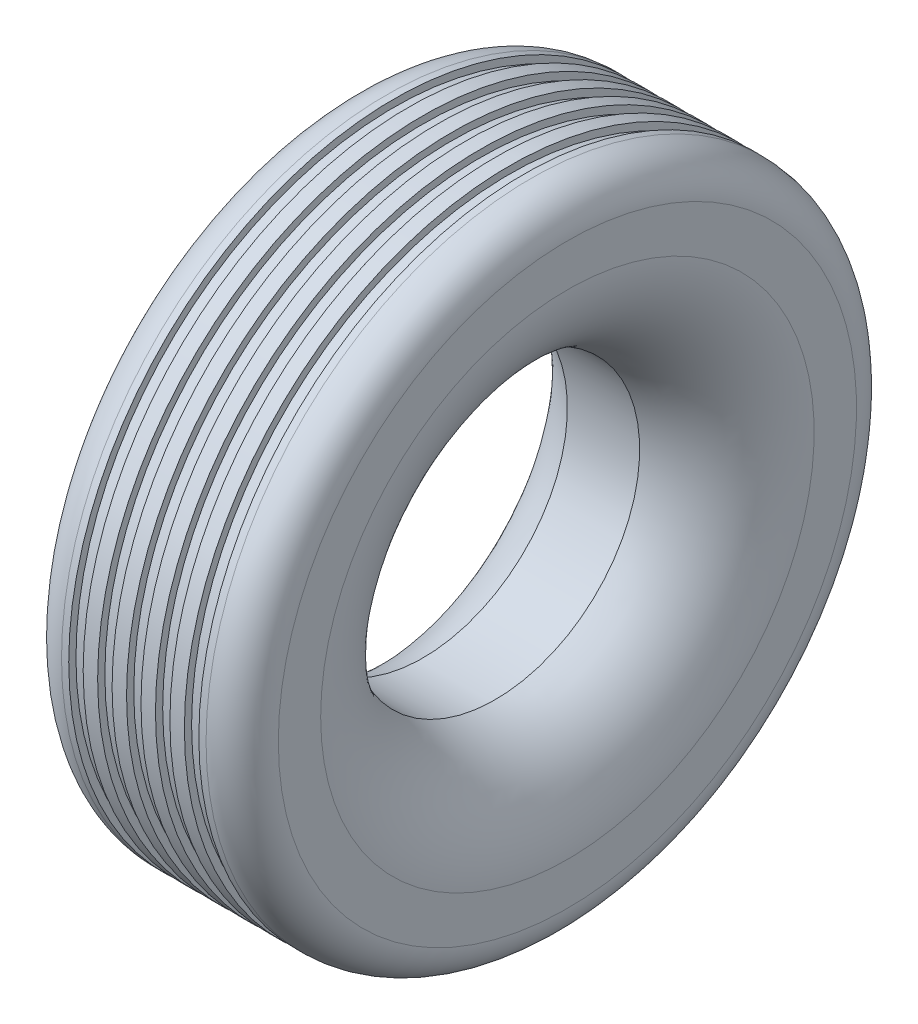
ISO-10303-21;
HEADER;
FILE_DESCRIPTION(('STEP AP214'),'2;1');
FILE_NAME('part.step','',(''),(''),'','','');
FILE_SCHEMA(('AUTOMOTIVE_DESIGN { 1 0 10303 214 1 1 1 1 }'));
ENDSEC;
DATA;
#1=APPLICATION_CONTEXT('core data for automotive mechanical design processes');
#2=APPLICATION_PROTOCOL_DEFINITION('international standard','automotive_design',2000,#1);
#3=PRODUCT_CONTEXT('',#1,'mechanical');
#4=PRODUCT('Part','Part','',(#3));
#5=PRODUCT_RELATED_PRODUCT_CATEGORY('part','',(#4));
#6=PRODUCT_DEFINITION_FORMATION('','',#4);
#7=PRODUCT_DEFINITION_CONTEXT('part definition',#1,'design');
#8=PRODUCT_DEFINITION('design','',#6,#7);
#9=PRODUCT_DEFINITION_SHAPE('','',#8);
#10=(LENGTH_UNIT() NAMED_UNIT(*) SI_UNIT(.MILLI.,.METRE.));
#11=(NAMED_UNIT(*) PLANE_ANGLE_UNIT() SI_UNIT($,.RADIAN.));
#12=(NAMED_UNIT(*) SI_UNIT($,.STERADIAN.) SOLID_ANGLE_UNIT());
#13=UNCERTAINTY_MEASURE_WITH_UNIT(LENGTH_MEASURE(1.E-05),#10,'distance_accuracy_value','');
#14=(GEOMETRIC_REPRESENTATION_CONTEXT(3) GLOBAL_UNCERTAINTY_ASSIGNED_CONTEXT((#13)) GLOBAL_UNIT_ASSIGNED_CONTEXT((#10,
#11,#12)) REPRESENTATION_CONTEXT('',''));
#15=CARTESIAN_POINT('',(0.,0.,0.));
#16=DIRECTION('',(0.,0.,1.));
#17=DIRECTION('',(1.,0.,0.));
#18=AXIS2_PLACEMENT_3D('',#15,#16,#17);
#19=CARTESIAN_POINT('',(100.,0.,0.));
#20=DIRECTION('',(-1.,0.,0.));
#21=DIRECTION('',(0.,0.,1.));
#22=AXIS2_PLACEMENT_3D('',#19,#20,#21);
#23=CYLINDRICAL_SURFACE('',#22,450.);
#24=CARTESIAN_POINT('',(50.0000000000003,0.,0.));
#25=DIRECTION('',(-1.,0.,0.));
#26=DIRECTION('',(0.,0.,1.));
#27=AXIS2_PLACEMENT_3D('',#24,#25,#26);
#28=CIRCLE('',#27,450.);
#29=CARTESIAN_POINT('',(50.0000000000003,0.,450.));
#30=VERTEX_POINT('',#29);
#31=EDGE_CURVE('E112',#30,#30,#28,.T.);
#32=ORIENTED_EDGE('',*,*,#31,.F.);
#33=EDGE_LOOP('',(#32));
#34=FACE_BOUND('',#33,.T.);
#35=CARTESIAN_POINT('',(60.0000000000004,0.,0.));
#36=DIRECTION('',(-1.,0.,0.));
#37=DIRECTION('',(0.,0.,1.));
#38=AXIS2_PLACEMENT_3D('',#35,#36,#37);
#39=CIRCLE('',#38,450.);
#40=CARTESIAN_POINT('',(60.0000000000004,0.,450.));
#41=VERTEX_POINT('',#40);
#42=EDGE_CURVE('E10',#41,#41,#39,.T.);
#43=ORIENTED_EDGE('',*,*,#42,.T.);
#44=EDGE_LOOP('',(#43));
#45=FACE_BOUND('',#44,.T.);
#46=ADVANCED_FACE('F30',(#34,#45),#23,.T.);
#47=CARTESIAN_POINT('',(60.0000000000004,450.,0.));
#48=DIRECTION('',(-1.,0.,0.));
#49=DIRECTION('',(0.,0.,1.));
#50=AXIS2_PLACEMENT_3D('',#47,#48,#49);
#51=PLANE('',#50);
#52=ORIENTED_EDGE('',*,*,#42,.F.);
#53=EDGE_LOOP('',(#52));
#54=FACE_BOUND('',#53,.T.);
#55=CARTESIAN_POINT('',(60.0000000000004,0.,0.));
#56=DIRECTION('',(-1.,0.,0.));
#57=DIRECTION('',(0.,0.,1.));
#58=AXIS2_PLACEMENT_3D('',#55,#56,#57);
#59=CIRCLE('',#58,440.);
#60=CARTESIAN_POINT('',(60.0000000000004,0.,440.));
#61=VERTEX_POINT('',#60);
#62=EDGE_CURVE('E36',#61,#61,#59,.T.);
#63=ORIENTED_EDGE('',*,*,#62,.T.);
#64=EDGE_LOOP('',(#63));
#65=FACE_BOUND('',#64,.T.);
#66=ADVANCED_FACE('F145',(#54,#65),#51,.F.);
#67=CARTESIAN_POINT('',(100.,0.,0.));
#68=DIRECTION('',(-1.,0.,0.));
#69=DIRECTION('',(0.,0.,1.));
#70=AXIS2_PLACEMENT_3D('',#67,#68,#69);
#71=CYLINDRICAL_SURFACE('',#70,440.);
#72=ORIENTED_EDGE('',*,*,#62,.F.);
#73=EDGE_LOOP('',(#72));
#74=FACE_BOUND('',#73,.T.);
#75=CARTESIAN_POINT('',(80.0000000000004,0.,0.));
#76=DIRECTION('',(-1.,0.,0.));
#77=DIRECTION('',(0.,0.,1.));
#78=AXIS2_PLACEMENT_3D('',#75,#76,#77);
#79=CIRCLE('',#78,440.);
#80=CARTESIAN_POINT('',(80.0000000000004,0.,440.));
#81=VERTEX_POINT('',#80);
#82=EDGE_CURVE('E40',#81,#81,#79,.T.);
#83=ORIENTED_EDGE('',*,*,#82,.T.);
#84=EDGE_LOOP('',(#83));
#85=FACE_BOUND('',#84,.T.);
#86=ADVANCED_FACE('F149',(#74,#85),#71,.T.);
#87=CARTESIAN_POINT('',(80.0000000000004,440.,0.));
#88=DIRECTION('',(1.,0.,0.));
#89=DIRECTION('',(0.,0.,-1.));
#90=AXIS2_PLACEMENT_3D('',#87,#88,#89);
#91=PLANE('',#90);
#92=ORIENTED_EDGE('',*,*,#82,.F.);
#93=EDGE_LOOP('',(#92));
#94=FACE_BOUND('',#93,.T.);
#95=CARTESIAN_POINT('',(80.0000000000004,0.,0.));
#96=DIRECTION('',(-1.,0.,0.));
#97=DIRECTION('',(0.,0.,1.));
#98=AXIS2_PLACEMENT_3D('',#95,#96,#97);
#99=CIRCLE('',#98,450.);
#100=CARTESIAN_POINT('',(80.0000000000004,0.,450.));
#101=VERTEX_POINT('',#100);
#102=EDGE_CURVE('E44',#101,#101,#99,.T.);
#103=ORIENTED_EDGE('',*,*,#102,.T.);
#104=EDGE_LOOP('',(#103));
#105=FACE_BOUND('',#104,.T.);
#106=ADVANCED_FACE('F154',(#94,#105),#91,.F.);
#107=CARTESIAN_POINT('',(100.,0.,0.));
#108=DIRECTION('',(-1.,0.,0.));
#109=DIRECTION('',(0.,0.,1.));
#110=AXIS2_PLACEMENT_3D('',#107,#108,#109);
#111=CYLINDRICAL_SURFACE('',#110,450.);
#112=ORIENTED_EDGE('',*,*,#102,.F.);
#113=EDGE_LOOP('',(#112));
#114=FACE_BOUND('',#113,.T.);
#115=CARTESIAN_POINT('',(100.,0.,0.));
#116=DIRECTION('',(-1.,0.,0.));
#117=DIRECTION('',(0.,0.,1.));
#118=AXIS2_PLACEMENT_3D('',#115,#116,#117);
#119=CIRCLE('',#118,450.);
#120=CARTESIAN_POINT('',(100.,0.,450.));
#121=VERTEX_POINT('',#120);
#122=EDGE_CURVE('E49',#121,#121,#119,.T.);
#123=ORIENTED_EDGE('',*,*,#122,.T.);
#124=EDGE_LOOP('',(#123));
#125=FACE_BOUND('',#124,.T.);
#126=ADVANCED_FACE('F160',(#114,#125),#111,.T.);
#127=CARTESIAN_POINT('',(100.,450.,0.));
#128=DIRECTION('',(-1.,0.,0.));
#129=DIRECTION('',(0.,0.,1.));
#130=AXIS2_PLACEMENT_3D('',#127,#128,#129);
#131=PLANE('',#130);
#132=ORIENTED_EDGE('',*,*,#122,.F.);
#133=EDGE_LOOP('',(#132));
#134=FACE_BOUND('',#133,.T.);
#135=CARTESIAN_POINT('',(100.,0.,0.));
#136=DIRECTION('',(-1.,0.,0.));
#137=DIRECTION('',(0.,0.,1.));
#138=AXIS2_PLACEMENT_3D('',#135,#136,#137);
#139=CIRCLE('',#138,440.);
#140=CARTESIAN_POINT('',(100.,0.,440.));
#141=VERTEX_POINT('',#140);
#142=EDGE_CURVE('E52',#141,#141,#139,.T.);
#143=ORIENTED_EDGE('',*,*,#142,.T.);
#144=EDGE_LOOP('',(#143));
#145=FACE_BOUND('',#144,.T.);
#146=ADVANCED_FACE('F164',(#134,#145),#131,.F.);
#147=CARTESIAN_POINT('',(100.,0.,0.));
#148=DIRECTION('',(-1.,0.,0.));
#149=DIRECTION('',(0.,0.,1.));
#150=AXIS2_PLACEMENT_3D('',#147,#148,#149);
#151=CYLINDRICAL_SURFACE('',#150,440.);
#152=ORIENTED_EDGE('',*,*,#142,.F.);
#153=EDGE_LOOP('',(#152));
#154=FACE_BOUND('',#153,.T.);
#155=CARTESIAN_POINT('',(120.,0.,0.));
#156=DIRECTION('',(-1.,0.,0.));
#157=DIRECTION('',(0.,0.,1.));
#158=AXIS2_PLACEMENT_3D('',#155,#156,#157);
#159=CIRCLE('',#158,440.);
#160=CARTESIAN_POINT('',(120.,0.,440.));
#161=VERTEX_POINT('',#160);
#162=EDGE_CURVE('E55',#161,#161,#159,.T.);
#163=ORIENTED_EDGE('',*,*,#162,.T.);
#164=EDGE_LOOP('',(#163));
#165=FACE_BOUND('',#164,.T.);
#166=ADVANCED_FACE('F168',(#154,#165),#151,.T.);
#167=CARTESIAN_POINT('',(120.,440.,0.));
#168=DIRECTION('',(1.,0.,0.));
#169=DIRECTION('',(0.,0.,-1.));
#170=AXIS2_PLACEMENT_3D('',#167,#168,#169);
#171=PLANE('',#170);
#172=ORIENTED_EDGE('',*,*,#162,.F.);
#173=EDGE_LOOP('',(#172));
#174=FACE_BOUND('',#173,.T.);
#175=CARTESIAN_POINT('',(120.,0.,0.));
#176=DIRECTION('',(-1.,0.,0.));
#177=DIRECTION('',(0.,0.,1.));
#178=AXIS2_PLACEMENT_3D('',#175,#176,#177);
#179=CIRCLE('',#178,450.);
#180=CARTESIAN_POINT('',(120.,0.,450.));
#181=VERTEX_POINT('',#180);
#182=EDGE_CURVE('E58',#181,#181,#179,.T.);
#183=ORIENTED_EDGE('',*,*,#182,.T.);
#184=EDGE_LOOP('',(#183));
#185=FACE_BOUND('',#184,.T.);
#186=ADVANCED_FACE('F172',(#174,#185),#171,.F.);
#187=CARTESIAN_POINT('',(100.,0.,0.));
#188=DIRECTION('',(-1.,0.,0.));
#189=DIRECTION('',(0.,0.,1.));
#190=AXIS2_PLACEMENT_3D('',#187,#188,#189);
#191=CYLINDRICAL_SURFACE('',#190,450.);
#192=ORIENTED_EDGE('',*,*,#182,.F.);
#193=EDGE_LOOP('',(#192));
#194=FACE_BOUND('',#193,.T.);
#195=CARTESIAN_POINT('',(140.,0.,0.));
#196=DIRECTION('',(-1.,0.,0.));
#197=DIRECTION('',(0.,0.,1.));
#198=AXIS2_PLACEMENT_3D('',#195,#196,#197);
#199=CIRCLE('',#198,450.);
#200=CARTESIAN_POINT('',(140.,0.,450.));
#201=VERTEX_POINT('',#200);
#202=EDGE_CURVE('E61',#201,#201,#199,.T.);
#203=ORIENTED_EDGE('',*,*,#202,.T.);
#204=EDGE_LOOP('',(#203));
#205=FACE_BOUND('',#204,.T.);
#206=ADVANCED_FACE('F176',(#194,#205),#191,.T.);
#207=CARTESIAN_POINT('',(140.,450.,0.));
#208=DIRECTION('',(-1.,0.,0.));
#209=DIRECTION('',(0.,0.,1.));
#210=AXIS2_PLACEMENT_3D('',#207,#208,#209);
#211=PLANE('',#210);
#212=ORIENTED_EDGE('',*,*,#202,.F.);
#213=EDGE_LOOP('',(#212));
#214=FACE_BOUND('',#213,.T.);
#215=CARTESIAN_POINT('',(140.,0.,0.));
#216=DIRECTION('',(-1.,0.,0.));
#217=DIRECTION('',(0.,0.,1.));
#218=AXIS2_PLACEMENT_3D('',#215,#216,#217);
#219=CIRCLE('',#218,440.);
#220=CARTESIAN_POINT('',(140.,0.,440.));
#221=VERTEX_POINT('',#220);
#222=EDGE_CURVE('E64',#221,#221,#219,.T.);
#223=ORIENTED_EDGE('',*,*,#222,.T.);
#224=EDGE_LOOP('',(#223));
#225=FACE_BOUND('',#224,.T.);
#226=ADVANCED_FACE('F180',(#214,#225),#211,.F.);
#227=CARTESIAN_POINT('',(100.,0.,0.));
#228=DIRECTION('',(-1.,0.,0.));
#229=DIRECTION('',(0.,0.,1.));
#230=AXIS2_PLACEMENT_3D('',#227,#228,#229);
#231=CYLINDRICAL_SURFACE('',#230,440.);
#232=ORIENTED_EDGE('',*,*,#222,.F.);
#233=EDGE_LOOP('',(#232));
#234=FACE_BOUND('',#233,.T.);
#235=CARTESIAN_POINT('',(160.,0.,0.));
#236=DIRECTION('',(-1.,0.,0.));
#237=DIRECTION('',(0.,0.,1.));
#238=AXIS2_PLACEMENT_3D('',#235,#236,#237);
#239=CIRCLE('',#238,440.);
#240=CARTESIAN_POINT('',(160.,0.,440.));
#241=VERTEX_POINT('',#240);
#242=EDGE_CURVE('E67',#241,#241,#239,.T.);
#243=ORIENTED_EDGE('',*,*,#242,.T.);
#244=EDGE_LOOP('',(#243));
#245=FACE_BOUND('',#244,.T.);
#246=ADVANCED_FACE('F184',(#234,#245),#231,.T.);
#247=CARTESIAN_POINT('',(160.,440.,0.));
#248=DIRECTION('',(1.,0.,0.));
#249=DIRECTION('',(0.,0.,-1.));
#250=AXIS2_PLACEMENT_3D('',#247,#248,#249);
#251=PLANE('',#250);
#252=ORIENTED_EDGE('',*,*,#242,.F.);
#253=EDGE_LOOP('',(#252));
#254=FACE_BOUND('',#253,.T.);
#255=CARTESIAN_POINT('',(160.,0.,0.));
#256=DIRECTION('',(-1.,0.,0.));
#257=DIRECTION('',(0.,0.,1.));
#258=AXIS2_PLACEMENT_3D('',#255,#256,#257);
#259=CIRCLE('',#258,450.);
#260=CARTESIAN_POINT('',(160.,0.,450.));
#261=VERTEX_POINT('',#260);
#262=EDGE_CURVE('E70',#261,#261,#259,.T.);
#263=ORIENTED_EDGE('',*,*,#262,.T.);
#264=EDGE_LOOP('',(#263));
#265=FACE_BOUND('',#264,.T.);
#266=ADVANCED_FACE('F188',(#254,#265),#251,.F.);
#267=CARTESIAN_POINT('',(100.,0.,0.));
#268=DIRECTION('',(-1.,0.,0.));
#269=DIRECTION('',(0.,0.,1.));
#270=AXIS2_PLACEMENT_3D('',#267,#268,#269);
#271=CYLINDRICAL_SURFACE('',#270,450.);
#272=ORIENTED_EDGE('',*,*,#262,.F.);
#273=EDGE_LOOP('',(#272));
#274=FACE_BOUND('',#273,.T.);
#275=CARTESIAN_POINT('',(180.,0.,0.));
#276=DIRECTION('',(-1.,0.,0.));
#277=DIRECTION('',(0.,0.,1.));
#278=AXIS2_PLACEMENT_3D('',#275,#276,#277);
#279=CIRCLE('',#278,450.);
#280=CARTESIAN_POINT('',(180.,0.,450.));
#281=VERTEX_POINT('',#280);
#282=EDGE_CURVE('E73',#281,#281,#279,.T.);
#283=ORIENTED_EDGE('',*,*,#282,.T.);
#284=EDGE_LOOP('',(#283));
#285=FACE_BOUND('',#284,.T.);
#286=ADVANCED_FACE('F192',(#274,#285),#271,.T.);
#287=CARTESIAN_POINT('',(180.,450.,0.));
#288=DIRECTION('',(-1.,0.,0.));
#289=DIRECTION('',(0.,0.,1.));
#290=AXIS2_PLACEMENT_3D('',#287,#288,#289);
#291=PLANE('',#290);
#292=ORIENTED_EDGE('',*,*,#282,.F.);
#293=EDGE_LOOP('',(#292));
#294=FACE_BOUND('',#293,.T.);
#295=CARTESIAN_POINT('',(180.,0.,0.));
#296=DIRECTION('',(-1.,0.,0.));
#297=DIRECTION('',(0.,0.,1.));
#298=AXIS2_PLACEMENT_3D('',#295,#296,#297);
#299=CIRCLE('',#298,440.);
#300=CARTESIAN_POINT('',(180.,0.,440.));
#301=VERTEX_POINT('',#300);
#302=EDGE_CURVE('E76',#301,#301,#299,.T.);
#303=ORIENTED_EDGE('',*,*,#302,.T.);
#304=EDGE_LOOP('',(#303));
#305=FACE_BOUND('',#304,.T.);
#306=ADVANCED_FACE('F196',(#294,#305),#291,.F.);
#307=CARTESIAN_POINT('',(100.,0.,0.));
#308=DIRECTION('',(-1.,0.,0.));
#309=DIRECTION('',(0.,0.,1.));
#310=AXIS2_PLACEMENT_3D('',#307,#308,#309);
#311=CYLINDRICAL_SURFACE('',#310,440.);
#312=ORIENTED_EDGE('',*,*,#302,.F.);
#313=EDGE_LOOP('',(#312));
#314=FACE_BOUND('',#313,.T.);
#315=CARTESIAN_POINT('',(200.,0.,0.));
#316=DIRECTION('',(-1.,0.,0.));
#317=DIRECTION('',(0.,0.,1.));
#318=AXIS2_PLACEMENT_3D('',#315,#316,#317);
#319=CIRCLE('',#318,440.);
#320=CARTESIAN_POINT('',(200.,0.,440.));
#321=VERTEX_POINT('',#320);
#322=EDGE_CURVE('E79',#321,#321,#319,.T.);
#323=ORIENTED_EDGE('',*,*,#322,.T.);
#324=EDGE_LOOP('',(#323));
#325=FACE_BOUND('',#324,.T.);
#326=ADVANCED_FACE('F200',(#314,#325),#311,.T.);
#327=CARTESIAN_POINT('',(200.,440.,0.));
#328=DIRECTION('',(1.,0.,0.));
#329=DIRECTION('',(0.,0.,-1.));
#330=AXIS2_PLACEMENT_3D('',#327,#328,#329);
#331=PLANE('',#330);
#332=ORIENTED_EDGE('',*,*,#322,.F.);
#333=EDGE_LOOP('',(#332));
#334=FACE_BOUND('',#333,.T.);
#335=CARTESIAN_POINT('',(200.,0.,0.));
#336=DIRECTION('',(-1.,0.,0.));
#337=DIRECTION('',(0.,0.,1.));
#338=AXIS2_PLACEMENT_3D('',#335,#336,#337);
#339=CIRCLE('',#338,450.);
#340=CARTESIAN_POINT('',(200.,0.,450.));
#341=VERTEX_POINT('',#340);
#342=EDGE_CURVE('E82',#341,#341,#339,.T.);
#343=ORIENTED_EDGE('',*,*,#342,.T.);
#344=EDGE_LOOP('',(#343));
#345=FACE_BOUND('',#344,.T.);
#346=ADVANCED_FACE('F204',(#334,#345),#331,.F.);
#347=CARTESIAN_POINT('',(100.,0.,0.));
#348=DIRECTION('',(-1.,0.,0.));
#349=DIRECTION('',(0.,0.,1.));
#350=AXIS2_PLACEMENT_3D('',#347,#348,#349);
#351=CYLINDRICAL_SURFACE('',#350,450.);
#352=ORIENTED_EDGE('',*,*,#342,.F.);
#353=EDGE_LOOP('',(#352));
#354=FACE_BOUND('',#353,.T.);
#355=CARTESIAN_POINT('',(220.,0.,0.));
#356=DIRECTION('',(-1.,0.,0.));
#357=DIRECTION('',(0.,0.,1.));
#358=AXIS2_PLACEMENT_3D('',#355,#356,#357);
#359=CIRCLE('',#358,450.);
#360=CARTESIAN_POINT('',(220.,0.,450.));
#361=VERTEX_POINT('',#360);
#362=EDGE_CURVE('E85',#361,#361,#359,.T.);
#363=ORIENTED_EDGE('',*,*,#362,.T.);
#364=EDGE_LOOP('',(#363));
#365=FACE_BOUND('',#364,.T.);
#366=ADVANCED_FACE('F208',(#354,#365),#351,.T.);
#367=CARTESIAN_POINT('',(220.,450.,0.));
#368=DIRECTION('',(-1.,0.,0.));
#369=DIRECTION('',(0.,0.,1.));
#370=AXIS2_PLACEMENT_3D('',#367,#368,#369);
#371=PLANE('',#370);
#372=ORIENTED_EDGE('',*,*,#362,.F.);
#373=EDGE_LOOP('',(#372));
#374=FACE_BOUND('',#373,.T.);
#375=CARTESIAN_POINT('',(220.,0.,0.));
#376=DIRECTION('',(-1.,0.,0.));
#377=DIRECTION('',(0.,0.,1.));
#378=AXIS2_PLACEMENT_3D('',#375,#376,#377);
#379=CIRCLE('',#378,440.);
#380=CARTESIAN_POINT('',(220.,0.,440.));
#381=VERTEX_POINT('',#380);
#382=EDGE_CURVE('E88',#381,#381,#379,.T.);
#383=ORIENTED_EDGE('',*,*,#382,.T.);
#384=EDGE_LOOP('',(#383));
#385=FACE_BOUND('',#384,.T.);
#386=ADVANCED_FACE('F212',(#374,#385),#371,.F.);
#387=CARTESIAN_POINT('',(100.,0.,0.));
#388=DIRECTION('',(-1.,0.,0.));
#389=DIRECTION('',(0.,0.,1.));
#390=AXIS2_PLACEMENT_3D('',#387,#388,#389);
#391=CYLINDRICAL_SURFACE('',#390,440.);
#392=ORIENTED_EDGE('',*,*,#382,.F.);
#393=EDGE_LOOP('',(#392));
#394=FACE_BOUND('',#393,.T.);
#395=CARTESIAN_POINT('',(240.,0.,0.));
#396=DIRECTION('',(-1.,0.,0.));
#397=DIRECTION('',(0.,0.,1.));
#398=AXIS2_PLACEMENT_3D('',#395,#396,#397);
#399=CIRCLE('',#398,440.);
#400=CARTESIAN_POINT('',(240.,0.,440.));
#401=VERTEX_POINT('',#400);
#402=EDGE_CURVE('E91',#401,#401,#399,.T.);
#403=ORIENTED_EDGE('',*,*,#402,.T.);
#404=EDGE_LOOP('',(#403));
#405=FACE_BOUND('',#404,.T.);
#406=ADVANCED_FACE('F216',(#394,#405),#391,.T.);
#407=CARTESIAN_POINT('',(240.,440.,0.));
#408=DIRECTION('',(1.,0.,0.));
#409=DIRECTION('',(0.,0.,-1.));
#410=AXIS2_PLACEMENT_3D('',#407,#408,#409);
#411=PLANE('',#410);
#412=ORIENTED_EDGE('',*,*,#402,.F.);
#413=EDGE_LOOP('',(#412));
#414=FACE_BOUND('',#413,.T.);
#415=CARTESIAN_POINT('',(240.,0.,0.));
#416=DIRECTION('',(-1.,0.,0.));
#417=DIRECTION('',(0.,0.,1.));
#418=AXIS2_PLACEMENT_3D('',#415,#416,#417);
#419=CIRCLE('',#418,450.);
#420=CARTESIAN_POINT('',(240.,0.,450.));
#421=VERTEX_POINT('',#420);
#422=EDGE_CURVE('E94',#421,#421,#419,.T.);
#423=ORIENTED_EDGE('',*,*,#422,.T.);
#424=EDGE_LOOP('',(#423));
#425=FACE_BOUND('',#424,.T.);
#426=ADVANCED_FACE('F220',(#414,#425),#411,.F.);
#427=CARTESIAN_POINT('',(100.,0.,0.));
#428=DIRECTION('',(-1.,0.,0.));
#429=DIRECTION('',(0.,0.,1.));
#430=AXIS2_PLACEMENT_3D('',#427,#428,#429);
#431=CYLINDRICAL_SURFACE('',#430,450.);
#432=ORIENTED_EDGE('',*,*,#422,.F.);
#433=EDGE_LOOP('',(#432));
#434=FACE_BOUND('',#433,.T.);
#435=CARTESIAN_POINT('',(250.,0.,0.));
#436=DIRECTION('',(-1.,0.,0.));
#437=DIRECTION('',(0.,0.,1.));
#438=AXIS2_PLACEMENT_3D('',#435,#436,#437);
#439=CIRCLE('',#438,450.);
#440=CARTESIAN_POINT('',(250.,0.,450.));
#441=VERTEX_POINT('',#440);
#442=EDGE_CURVE('E97',#441,#441,#439,.T.);
#443=ORIENTED_EDGE('',*,*,#442,.T.);
#444=EDGE_LOOP('',(#443));
#445=FACE_BOUND('',#444,.T.);
#446=ADVANCED_FACE('F224',(#434,#445),#431,.T.);
#447=CARTESIAN_POINT('',(250.,0.,0.));
#448=DIRECTION('',(-1.,0.,0.));
#449=DIRECTION('',(0.,0.,1.));
#450=AXIS2_PLACEMENT_3D('',#447,#448,#449);
#451=TOROIDAL_SURFACE('',#450,400.,50.);
#452=ORIENTED_EDGE('',*,*,#442,.F.);
#453=EDGE_LOOP('',(#452));
#454=FACE_BOUND('',#453,.T.);
#455=CARTESIAN_POINT('',(300.,0.,0.));
#456=DIRECTION('',(-1.,0.,0.));
#457=DIRECTION('',(0.,0.,1.));
#458=AXIS2_PLACEMENT_3D('',#455,#456,#457);
#459=CIRCLE('',#458,400.);
#460=CARTESIAN_POINT('',(300.,0.,400.));
#461=VERTEX_POINT('',#460);
#462=EDGE_CURVE('E100',#461,#461,#459,.T.);
#463=ORIENTED_EDGE('',*,*,#462,.T.);
#464=EDGE_LOOP('',(#463));
#465=FACE_BOUND('',#464,.T.);
#466=ADVANCED_FACE('F228',(#454,#465),#451,.T.);
#467=CARTESIAN_POINT('',(300.,341.42135623731,0.));
#468=DIRECTION('',(-1.,0.,0.));
#469=DIRECTION('',(0.,0.,1.));
#470=AXIS2_PLACEMENT_3D('',#467,#468,#469);
#471=PLANE('',#470);
#472=ORIENTED_EDGE('',*,*,#462,.F.);
#473=EDGE_LOOP('',(#472));
#474=FACE_BOUND('',#473,.T.);
#475=CARTESIAN_POINT('',(300.,0.,0.));
#476=DIRECTION('',(-1.,0.,0.));
#477=DIRECTION('',(0.,0.,1.));
#478=AXIS2_PLACEMENT_3D('',#475,#476,#477);
#479=CIRCLE('',#478,341.42135623731);
#480=CARTESIAN_POINT('',(300.,0.,341.42135623731));
#481=VERTEX_POINT('',#480);
#482=EDGE_CURVE('E103',#481,#481,#479,.T.);
#483=ORIENTED_EDGE('',*,*,#482,.T.);
#484=EDGE_LOOP('',(#483));
#485=FACE_BOUND('',#484,.T.);
#486=ADVANCED_FACE('F232',(#474,#485),#471,.F.);
#487=CARTESIAN_POINT('',(150.,0.,0.));
#488=DIRECTION('',(-1.,0.,0.));
#489=DIRECTION('',(0.,0.,1.));
#490=AXIS2_PLACEMENT_3D('',#487,#488,#489);
#491=TOROIDAL_SURFACE('',#490,341.42135623731,150.);
#492=ORIENTED_EDGE('',*,*,#482,.F.);
#493=EDGE_LOOP('',(#492));
#494=FACE_BOUND('',#493,.T.);
#495=CARTESIAN_POINT('',(200.,0.,0.));
#496=DIRECTION('',(-1.,0.,0.));
#497=DIRECTION('',(0.,0.,1.));
#498=AXIS2_PLACEMENT_3D('',#495,#496,#497);
#499=CIRCLE('',#498,200.);
#500=CARTESIAN_POINT('',(200.,0.,200.));
#501=VERTEX_POINT('',#500);
#502=EDGE_CURVE('E115',#501,#501,#499,.T.);
#503=ORIENTED_EDGE('',*,*,#502,.T.);
#504=EDGE_LOOP('',(#503));
#505=FACE_BOUND('',#504,.T.);
#506=ADVANCED_FACE('F129',(#494,#505),#491,.T.);
#507=CARTESIAN_POINT('',(150.,0.,0.));
#508=DIRECTION('',(-1.,0.,0.));
#509=DIRECTION('',(0.,0.,1.));
#510=AXIS2_PLACEMENT_3D('',#507,#508,#509);
#511=TOROIDAL_SURFACE('',#510,341.42135623731,150.);
#512=CARTESIAN_POINT('',(100.,0.,0.));
#513=DIRECTION('',(-1.,0.,0.));
#514=DIRECTION('',(0.,0.,1.));
#515=AXIS2_PLACEMENT_3D('',#512,#513,#514);
#516=CIRCLE('',#515,200.);
#517=CARTESIAN_POINT('',(100.,0.,200.));
#518=VERTEX_POINT('',#517);
#519=EDGE_CURVE('E118',#518,#518,#516,.T.);
#520=ORIENTED_EDGE('',*,*,#519,.F.);
#521=EDGE_LOOP('',(#520));
#522=FACE_BOUND('',#521,.T.);
#523=CARTESIAN_POINT('',(0.,0.,0.));
#524=DIRECTION('',(-1.,0.,0.));
#525=DIRECTION('',(0.,0.,1.));
#526=AXIS2_PLACEMENT_3D('',#523,#524,#525);
#527=CIRCLE('',#526,341.42135623731);
#528=CARTESIAN_POINT('',(0.,0.,341.42135623731));
#529=VERTEX_POINT('',#528);
#530=EDGE_CURVE('E106',#529,#529,#527,.T.);
#531=ORIENTED_EDGE('',*,*,#530,.T.);
#532=EDGE_LOOP('',(#531));
#533=FACE_BOUND('',#532,.T.);
#534=ADVANCED_FACE('F125',(#522,#533),#511,.T.);
#535=CARTESIAN_POINT('',(0.,341.42135623731,0.));
#536=DIRECTION('',(1.,0.,0.));
#537=DIRECTION('',(0.,0.,-1.));
#538=AXIS2_PLACEMENT_3D('',#535,#536,#537);
#539=PLANE('',#538);
#540=ORIENTED_EDGE('',*,*,#530,.F.);
#541=EDGE_LOOP('',(#540));
#542=FACE_BOUND('',#541,.T.);
#543=CARTESIAN_POINT('',(0.,0.,0.));
#544=DIRECTION('',(-1.,0.,0.));
#545=DIRECTION('',(0.,0.,1.));
#546=AXIS2_PLACEMENT_3D('',#543,#544,#545);
#547=CIRCLE('',#546,400.);
#548=CARTESIAN_POINT('',(0.,0.,400.));
#549=VERTEX_POINT('',#548);
#550=EDGE_CURVE('E109',#549,#549,#547,.T.);
#551=ORIENTED_EDGE('',*,*,#550,.T.);
#552=EDGE_LOOP('',(#551));
#553=FACE_BOUND('',#552,.T.);
#554=ADVANCED_FACE('F128',(#542,#553),#539,.F.);
#555=CARTESIAN_POINT('',(50.,0.,0.));
#556=DIRECTION('',(-1.,0.,0.));
#557=DIRECTION('',(0.,0.,1.));
#558=AXIS2_PLACEMENT_3D('',#555,#556,#557);
#559=TOROIDAL_SURFACE('',#558,400.,50.);
#560=ORIENTED_EDGE('',*,*,#550,.F.);
#561=EDGE_LOOP('',(#560));
#562=FACE_BOUND('',#561,.T.);
#563=ORIENTED_EDGE('',*,*,#31,.T.);
#564=EDGE_LOOP('',(#563));
#565=FACE_BOUND('',#564,.T.);
#566=ADVANCED_FACE('F135',(#562,#565),#559,.T.);
#567=CARTESIAN_POINT('',(300.,0.,0.));
#568=DIRECTION('',(-1.,0.,0.));
#569=DIRECTION('',(0.,0.,1.));
#570=AXIS2_PLACEMENT_3D('',#567,#568,#569);
#571=CYLINDRICAL_SURFACE('',#570,200.);
#572=ORIENTED_EDGE('',*,*,#519,.T.);
#573=EDGE_LOOP('',(#572));
#574=FACE_BOUND('',#573,.T.);
#575=ORIENTED_EDGE('',*,*,#502,.F.);
#576=EDGE_LOOP('',(#575));
#577=FACE_BOUND('',#576,.T.);
#578=ADVANCED_FACE('F122',(#574,#577),#571,.F.);
#579=CLOSED_SHELL('',(#46,#66,#86,#106,#126,#146,#166,#186,#206,#226,#246,#266,#286,#306,#326,
#346,#366,#386,#406,#426,#446,#466,#486,#506,#534,#554,#566,#578));
#580=MANIFOLD_SOLID_BREP('B2',#579);
#581=ADVANCED_BREP_SHAPE_REPRESENTATION('',(#18,#580),#14);
#582=SHAPE_DEFINITION_REPRESENTATION(#9,#581);
ENDSEC;
END-ISO-10303-21;
